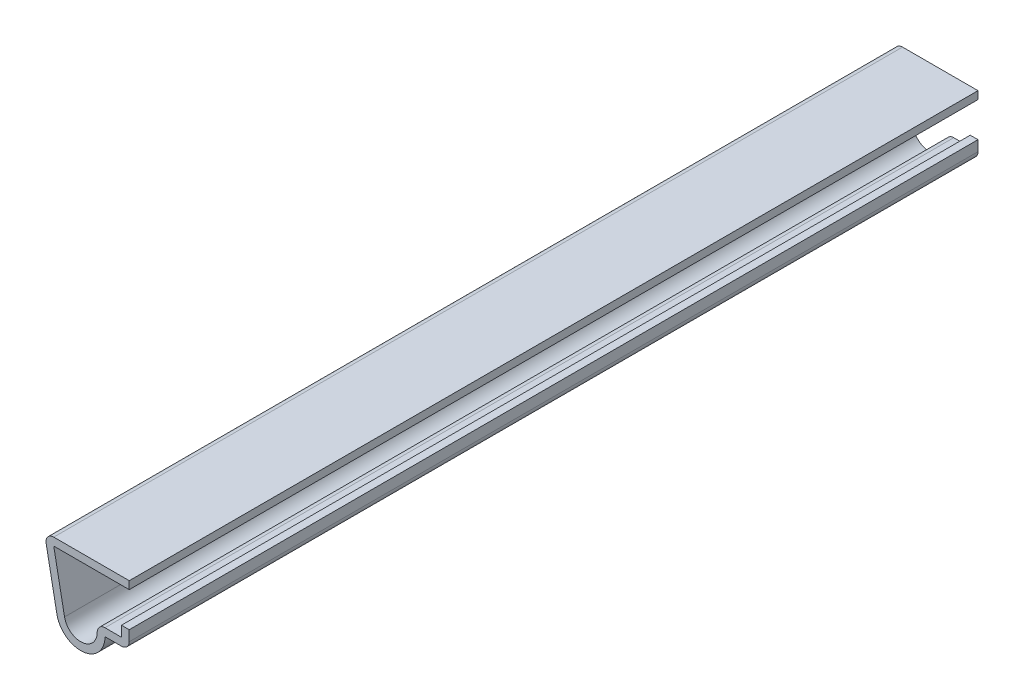
ISO-10303-21;
HEADER;
FILE_DESCRIPTION(('STEP AP214'),'2;1');
FILE_NAME('part.step','',(''),(''),'','','');
FILE_SCHEMA(('AUTOMOTIVE_DESIGN { 1 0 10303 214 1 1 1 1 }'));
ENDSEC;
DATA;
#1=APPLICATION_CONTEXT('core data for automotive mechanical design processes');
#2=APPLICATION_PROTOCOL_DEFINITION('international standard','automotive_design',2000,#1);
#3=PRODUCT_CONTEXT('',#1,'mechanical');
#4=PRODUCT('Part','Part','',(#3));
#5=PRODUCT_RELATED_PRODUCT_CATEGORY('part','',(#4));
#6=PRODUCT_DEFINITION_FORMATION('','',#4);
#7=PRODUCT_DEFINITION_CONTEXT('part definition',#1,'design');
#8=PRODUCT_DEFINITION('design','',#6,#7);
#9=PRODUCT_DEFINITION_SHAPE('','',#8);
#10=(LENGTH_UNIT() NAMED_UNIT(*) SI_UNIT(.MILLI.,.METRE.));
#11=(NAMED_UNIT(*) PLANE_ANGLE_UNIT() SI_UNIT($,.RADIAN.));
#12=(NAMED_UNIT(*) SI_UNIT($,.STERADIAN.) SOLID_ANGLE_UNIT());
#13=UNCERTAINTY_MEASURE_WITH_UNIT(LENGTH_MEASURE(1.E-05),#10,'distance_accuracy_value','');
#14=(GEOMETRIC_REPRESENTATION_CONTEXT(3) GLOBAL_UNCERTAINTY_ASSIGNED_CONTEXT((#13)) GLOBAL_UNIT_ASSIGNED_CONTEXT((#10,
#11,#12)) REPRESENTATION_CONTEXT('',''));
#15=CARTESIAN_POINT('',(0.,0.,0.));
#16=DIRECTION('',(0.,0.,1.));
#17=DIRECTION('',(1.,0.,0.));
#18=AXIS2_PLACEMENT_3D('',#15,#16,#17);
#19=CARTESIAN_POINT('',(-11.1125,6.9215,-111.125));
#20=DIRECTION('',(0.,-1.,0.));
#21=DIRECTION('',(1.,0.,0.));
#22=AXIS2_PLACEMENT_3D('',#19,#20,#21);
#23=PLANE('',#22);
#24=DIRECTION('',(1.,0.,0.));
#25=VECTOR('',#24,1.);
#26=CARTESIAN_POINT('',(-11.1125,6.9215,0.));
#27=LINE('',#26,#25);
#28=CARTESIAN_POINT('',(-9.8820912593925,6.9215,0.));
#29=VERTEX_POINT('',#28);
#30=CARTESIAN_POINT('',(0.,6.9215,0.));
#31=VERTEX_POINT('',#30);
#32=EDGE_CURVE('E192',#29,#31,#27,.T.);
#33=ORIENTED_EDGE('',*,*,#32,.F.);
#34=DIRECTION('',(0.,0.,1.));
#35=VECTOR('',#34,1.);
#36=CARTESIAN_POINT('',(-9.8820912593925,6.9215,-111.125));
#37=LINE('',#36,#35);
#38=CARTESIAN_POINT('',(-9.8820912593925,6.9215,-111.125));
#39=VERTEX_POINT('',#38);
#40=EDGE_CURVE('E165',#39,#29,#37,.T.);
#41=ORIENTED_EDGE('',*,*,#40,.F.);
#42=DIRECTION('',(1.,0.,0.));
#43=VECTOR('',#42,1.);
#44=CARTESIAN_POINT('',(-11.1125,6.9215,-111.125));
#45=LINE('',#44,#43);
#46=CARTESIAN_POINT('',(0.,6.9215,-111.125));
#47=VERTEX_POINT('',#46);
#48=EDGE_CURVE('E147',#39,#47,#45,.T.);
#49=ORIENTED_EDGE('',*,*,#48,.T.);
#50=DIRECTION('',(0.,0.,1.));
#51=VECTOR('',#50,1.);
#52=CARTESIAN_POINT('',(0.,6.9215,-111.125));
#53=LINE('',#52,#51);
#54=EDGE_CURVE('E155',#47,#31,#53,.T.);
#55=ORIENTED_EDGE('',*,*,#54,.T.);
#56=EDGE_LOOP('',(#33,#41,#49,#55));
#57=FACE_BOUND('',#56,.T.);
#58=ADVANCED_FACE('F35',(#57),#23,.T.);
#59=CARTESIAN_POINT('',(-8.47001912007891,-0.408411472047341,-111.125));
#60=DIRECTION('',(0.981944937507597,0.189166962504558,0.));
#61=DIRECTION('',(-0.189166962504558,0.981944937507597,0.));
#62=AXIS2_PLACEMENT_3D('',#59,#60,#61);
#63=PLANE('',#62);
#64=DIRECTION('',(-0.189166962504558,0.981944937507597,0.));
#65=VECTOR('',#64,1.);
#66=CARTESIAN_POINT('',(-8.47001912007891,-0.408411472047341,0.));
#67=LINE('',#66,#65);
#68=CARTESIAN_POINT('',(-8.47001912007891,-0.408411472047341,0.));
#69=VERTEX_POINT('',#68);
#70=EDGE_CURVE('E166',#69,#29,#67,.T.);
#71=ORIENTED_EDGE('',*,*,#70,.F.);
#72=DIRECTION('',(0.,0.,1.));
#73=VECTOR('',#72,1.);
#74=CARTESIAN_POINT('',(-8.47001912007891,-0.408411472047341,-111.125));
#75=LINE('',#74,#73);
#76=CARTESIAN_POINT('',(-8.47001912007891,-0.408411472047341,-111.125));
#77=VERTEX_POINT('',#76);
#78=EDGE_CURVE('E217',#77,#69,#75,.T.);
#79=ORIENTED_EDGE('',*,*,#78,.F.);
#80=DIRECTION('',(-0.189166962504558,0.981944937507597,0.));
#81=VECTOR('',#80,1.);
#82=CARTESIAN_POINT('',(-8.47001912007891,-0.408411472047341,-111.125));
#83=LINE('',#82,#81);
#84=EDGE_CURVE('E163',#77,#39,#83,.T.);
#85=ORIENTED_EDGE('',*,*,#84,.T.);
#86=ORIENTED_EDGE('',*,*,#40,.T.);
#87=EDGE_LOOP('',(#71,#79,#85,#86));
#88=FACE_BOUND('',#87,.T.);
#89=ADVANCED_FACE('F267',(#88),#63,.T.);
#90=CARTESIAN_POINT('',(-6.35,0.,-111.125));
#91=DIRECTION('',(0.,0.,1.));
#92=DIRECTION('',(1.,0.,0.));
#93=AXIS2_PLACEMENT_3D('',#90,#91,#92);
#94=CYLINDRICAL_SURFACE('',#93,2.159);
#95=CARTESIAN_POINT('',(-6.35,0.,0.));
#96=DIRECTION('',(0.,0.,1.));
#97=DIRECTION('',(1.,0.,0.));
#98=AXIS2_PLACEMENT_3D('',#95,#96,#97);
#99=CIRCLE('',#98,2.159);
#100=CARTESIAN_POINT('',(-4.191,0.,0.));
#101=VERTEX_POINT('',#100);
#102=EDGE_CURVE('E169',#101,#69,#99,.F.);
#103=ORIENTED_EDGE('',*,*,#102,.F.);
#104=DIRECTION('',(0.,0.,1.));
#105=VECTOR('',#104,1.);
#106=CARTESIAN_POINT('',(-4.191,0.,-111.125));
#107=LINE('',#106,#105);
#108=CARTESIAN_POINT('',(-4.191,0.,-111.125));
#109=VERTEX_POINT('',#108);
#110=EDGE_CURVE('E252',#101,#109,#107,.F.);
#111=ORIENTED_EDGE('',*,*,#110,.T.);
#112=CARTESIAN_POINT('',(-6.35,0.,-111.125));
#113=DIRECTION('',(0.,0.,1.));
#114=DIRECTION('',(1.,0.,0.));
#115=AXIS2_PLACEMENT_3D('',#112,#113,#114);
#116=CIRCLE('',#115,2.159);
#117=EDGE_CURVE('E189',#109,#77,#116,.F.);
#118=ORIENTED_EDGE('',*,*,#117,.T.);
#119=ORIENTED_EDGE('',*,*,#78,.T.);
#120=EDGE_LOOP('',(#103,#111,#118,#119));
#121=FACE_BOUND('',#120,.T.);
#122=ADVANCED_FACE('F315',(#121),#94,.F.);
#123=CARTESIAN_POINT('',(0.,1.016,-111.125));
#124=DIRECTION('',(0.,1.,0.));
#125=DIRECTION('',(-1.,0.,0.));
#126=AXIS2_PLACEMENT_3D('',#123,#124,#125);
#127=PLANE('',#126);
#128=DIRECTION('',(-1.,0.,0.));
#129=VECTOR('',#128,1.);
#130=CARTESIAN_POINT('',(0.,1.016,-111.125));
#131=LINE('',#130,#129);
#132=CARTESIAN_POINT('',(-1.016,1.016,-111.125));
#133=VERTEX_POINT('',#132);
#134=CARTESIAN_POINT('',(-3.175,1.016,-111.125));
#135=VERTEX_POINT('',#134);
#136=EDGE_CURVE('E186',#133,#135,#131,.T.);
#137=ORIENTED_EDGE('',*,*,#136,.T.);
#138=DIRECTION('',(0.,0.,1.));
#139=VECTOR('',#138,1.);
#140=CARTESIAN_POINT('',(-3.175,1.016,-111.125));
#141=LINE('',#140,#139);
#142=CARTESIAN_POINT('',(-3.175,1.016,0.));
#143=VERTEX_POINT('',#142);
#144=EDGE_CURVE('E249',#135,#143,#141,.T.);
#145=ORIENTED_EDGE('',*,*,#144,.T.);
#146=DIRECTION('',(-1.,0.,0.));
#147=VECTOR('',#146,1.);
#148=CARTESIAN_POINT('',(0.,1.016,0.));
#149=LINE('',#148,#147);
#150=CARTESIAN_POINT('',(-1.016,1.016,0.));
#151=VERTEX_POINT('',#150);
#152=EDGE_CURVE('E211',#151,#143,#149,.T.);
#153=ORIENTED_EDGE('',*,*,#152,.F.);
#154=DIRECTION('',(0.,0.,1.));
#155=VECTOR('',#154,1.);
#156=CARTESIAN_POINT('',(-1.016,1.016,-111.125));
#157=LINE('',#156,#155);
#158=EDGE_CURVE('E220',#133,#151,#157,.T.);
#159=ORIENTED_EDGE('',*,*,#158,.F.);
#160=EDGE_LOOP('',(#137,#145,#153,#159));
#161=FACE_BOUND('',#160,.T.);
#162=ADVANCED_FACE('F278',(#161),#127,.T.);
#163=CARTESIAN_POINT('',(-1.016,2.38125,-111.125));
#164=DIRECTION('',(-1.,0.,0.));
#165=DIRECTION('',(0.,-1.,0.));
#166=AXIS2_PLACEMENT_3D('',#163,#164,#165);
#167=PLANE('',#166);
#168=DIRECTION('',(0.,-1.,0.));
#169=VECTOR('',#168,1.);
#170=CARTESIAN_POINT('',(-1.016,2.38125,0.));
#171=LINE('',#170,#169);
#172=CARTESIAN_POINT('',(-1.016,2.38125,0.));
#173=VERTEX_POINT('',#172);
#174=EDGE_CURVE('E208',#173,#151,#171,.T.);
#175=ORIENTED_EDGE('',*,*,#174,.F.);
#176=DIRECTION('',(0.,0.,1.));
#177=VECTOR('',#176,1.);
#178=CARTESIAN_POINT('',(-1.016,2.38125,-111.125));
#179=LINE('',#178,#177);
#180=CARTESIAN_POINT('',(-1.016,2.38125,-111.125));
#181=VERTEX_POINT('',#180);
#182=EDGE_CURVE('E222',#181,#173,#179,.T.);
#183=ORIENTED_EDGE('',*,*,#182,.F.);
#184=DIRECTION('',(0.,-1.,0.));
#185=VECTOR('',#184,1.);
#186=CARTESIAN_POINT('',(-1.016,2.38125,-111.125));
#187=LINE('',#186,#185);
#188=EDGE_CURVE('E183',#181,#133,#187,.T.);
#189=ORIENTED_EDGE('',*,*,#188,.T.);
#190=ORIENTED_EDGE('',*,*,#158,.T.);
#191=EDGE_LOOP('',(#175,#183,#189,#190));
#192=FACE_BOUND('',#191,.T.);
#193=ADVANCED_FACE('F283',(#192),#167,.T.);
#194=CARTESIAN_POINT('',(-1.016,2.38125,-111.125));
#195=DIRECTION('',(0.,-1.,0.));
#196=DIRECTION('',(0.,0.,-1.));
#197=AXIS2_PLACEMENT_3D('',#194,#195,#196);
#198=PLANE('',#197);
#199=DIRECTION('',(1.,0.,0.));
#200=VECTOR('',#199,1.);
#201=CARTESIAN_POINT('',(-1.016,2.38125,0.));
#202=LINE('',#201,#200);
#203=CARTESIAN_POINT('',(0.,2.38125,0.));
#204=VERTEX_POINT('',#203);
#205=EDGE_CURVE('E206',#173,#204,#202,.T.);
#206=ORIENTED_EDGE('',*,*,#205,.T.);
#207=DIRECTION('',(0.,0.,1.));
#208=VECTOR('',#207,1.);
#209=CARTESIAN_POINT('',(0.,2.38125,-111.125));
#210=LINE('',#209,#208);
#211=CARTESIAN_POINT('',(0.,2.38125,-111.125));
#212=VERTEX_POINT('',#211);
#213=EDGE_CURVE('E224',#212,#204,#210,.T.);
#214=ORIENTED_EDGE('',*,*,#213,.F.);
#215=DIRECTION('',(1.,0.,0.));
#216=VECTOR('',#215,1.);
#217=CARTESIAN_POINT('',(-1.016,2.38125,-111.125));
#218=LINE('',#217,#216);
#219=EDGE_CURVE('E181',#181,#212,#218,.T.);
#220=ORIENTED_EDGE('',*,*,#219,.F.);
#221=ORIENTED_EDGE('',*,*,#182,.T.);
#222=EDGE_LOOP('',(#206,#214,#220,#221));
#223=FACE_BOUND('',#222,.T.);
#224=ADVANCED_FACE('F290',(#223),#198,.F.);
#225=CARTESIAN_POINT('',(0.,2.38125,-111.125));
#226=DIRECTION('',(-1.,0.,0.));
#227=DIRECTION('',(0.,-1.,0.));
#228=AXIS2_PLACEMENT_3D('',#225,#226,#227);
#229=PLANE('',#228);
#230=DIRECTION('',(0.,-1.,0.));
#231=VECTOR('',#230,1.);
#232=CARTESIAN_POINT('',(0.,2.38125,0.));
#233=LINE('',#232,#231);
#234=CARTESIAN_POINT('',(0.,1.016,0.));
#235=VERTEX_POINT('',#234);
#236=EDGE_CURVE('E203',#204,#235,#233,.T.);
#237=ORIENTED_EDGE('',*,*,#236,.T.);
#238=DIRECTION('',(0.,0.,1.));
#239=VECTOR('',#238,1.);
#240=CARTESIAN_POINT('',(0.,1.016,-111.125));
#241=LINE('',#240,#239);
#242=CARTESIAN_POINT('',(0.,1.016,-111.125));
#243=VERTEX_POINT('',#242);
#244=EDGE_CURVE('E242',#235,#243,#241,.F.);
#245=ORIENTED_EDGE('',*,*,#244,.T.);
#246=DIRECTION('',(0.,-1.,0.));
#247=VECTOR('',#246,1.);
#248=CARTESIAN_POINT('',(0.,2.38125,-111.125));
#249=LINE('',#248,#247);
#250=EDGE_CURVE('E179',#212,#243,#249,.T.);
#251=ORIENTED_EDGE('',*,*,#250,.F.);
#252=ORIENTED_EDGE('',*,*,#213,.T.);
#253=EDGE_LOOP('',(#237,#245,#251,#252));
#254=FACE_BOUND('',#253,.T.);
#255=ADVANCED_FACE('F292',(#254),#229,.F.);
#256=CARTESIAN_POINT('',(0.,0.,-111.125));
#257=DIRECTION('',(0.,1.,0.));
#258=DIRECTION('',(-1.,0.,0.));
#259=AXIS2_PLACEMENT_3D('',#256,#257,#258);
#260=PLANE('',#259);
#261=DIRECTION('',(-1.,0.,0.));
#262=VECTOR('',#261,1.);
#263=CARTESIAN_POINT('',(0.,0.,-111.125));
#264=LINE('',#263,#262);
#265=CARTESIAN_POINT('',(-1.016,0.,-111.125));
#266=VERTEX_POINT('',#265);
#267=CARTESIAN_POINT('',(-3.175,0.,-111.125));
#268=VERTEX_POINT('',#267);
#269=EDGE_CURVE('E177',#266,#268,#264,.T.);
#270=ORIENTED_EDGE('',*,*,#269,.F.);
#271=DIRECTION('',(0.,0.,1.));
#272=VECTOR('',#271,1.);
#273=CARTESIAN_POINT('',(-1.016,0.,-111.125));
#274=LINE('',#273,#272);
#275=CARTESIAN_POINT('',(-1.016,0.,0.));
#276=VERTEX_POINT('',#275);
#277=EDGE_CURVE('E216',#266,#276,#274,.T.);
#278=ORIENTED_EDGE('',*,*,#277,.T.);
#279=DIRECTION('',(-1.,0.,0.));
#280=VECTOR('',#279,1.);
#281=CARTESIAN_POINT('',(0.,0.,0.));
#282=LINE('',#281,#280);
#283=CARTESIAN_POINT('',(-3.175,0.,0.));
#284=VERTEX_POINT('',#283);
#285=EDGE_CURVE('E201',#276,#284,#282,.T.);
#286=ORIENTED_EDGE('',*,*,#285,.T.);
#287=DIRECTION('',(0.,0.,1.));
#288=VECTOR('',#287,1.);
#289=CARTESIAN_POINT('',(-3.175,0.,-111.125));
#290=LINE('',#289,#288);
#291=EDGE_CURVE('E227',#268,#284,#290,.T.);
#292=ORIENTED_EDGE('',*,*,#291,.F.);
#293=EDGE_LOOP('',(#270,#278,#286,#292));
#294=FACE_BOUND('',#293,.T.);
#295=ADVANCED_FACE('F300',(#294),#260,.F.);
#296=CARTESIAN_POINT('',(-6.35,0.,-111.125));
#297=DIRECTION('',(0.,0.,1.));
#298=DIRECTION('',(1.,0.,0.));
#299=AXIS2_PLACEMENT_3D('',#296,#297,#298);
#300=CYLINDRICAL_SURFACE('',#299,3.175);
#301=CARTESIAN_POINT('',(-6.35,0.,0.));
#302=DIRECTION('',(0.,0.,-1.));
#303=DIRECTION('',(-1.,0.,0.));
#304=AXIS2_PLACEMENT_3D('',#301,#302,#303);
#305=CIRCLE('',#304,3.175);
#306=CARTESIAN_POINT('',(-9.46767517658662,-0.600605105951972,0.));
#307=VERTEX_POINT('',#306);
#308=EDGE_CURVE('E199',#284,#307,#305,.T.);
#309=ORIENTED_EDGE('',*,*,#308,.T.);
#310=DIRECTION('',(0.,0.,1.));
#311=VECTOR('',#310,1.);
#312=CARTESIAN_POINT('',(-9.46767517658662,-0.600605105951972,-111.125));
#313=LINE('',#312,#311);
#314=CARTESIAN_POINT('',(-9.46767517658662,-0.600605105951972,-111.125));
#315=VERTEX_POINT('',#314);
#316=EDGE_CURVE('E230',#315,#307,#313,.T.);
#317=ORIENTED_EDGE('',*,*,#316,.F.);
#318=CARTESIAN_POINT('',(-6.35,0.,-111.125));
#319=DIRECTION('',(0.,0.,-1.));
#320=DIRECTION('',(-1.,0.,0.));
#321=AXIS2_PLACEMENT_3D('',#318,#319,#320);
#322=CIRCLE('',#321,3.175);
#323=EDGE_CURVE('E175',#268,#315,#322,.T.);
#324=ORIENTED_EDGE('',*,*,#323,.F.);
#325=ORIENTED_EDGE('',*,*,#291,.T.);
#326=EDGE_LOOP('',(#309,#317,#324,#325));
#327=FACE_BOUND('',#326,.T.);
#328=ADVANCED_FACE('F305',(#327),#300,.T.);
#329=CARTESIAN_POINT('',(-9.46767517658662,-0.600605105951972,-111.125));
#330=DIRECTION('',(0.981944937507597,0.189166962504558,0.));
#331=DIRECTION('',(-0.189166962504558,0.981944937507597,0.));
#332=AXIS2_PLACEMENT_3D('',#329,#330,#331);
#333=PLANE('',#332);
#334=DIRECTION('',(-0.189166962504558,0.981944937507597,0.));
#335=VECTOR('',#334,1.);
#336=CARTESIAN_POINT('',(-9.46767517658662,-0.600605105951972,0.));
#337=LINE('',#336,#335);
#338=CARTESIAN_POINT('',(-10.8797473159002,6.72930636609537,0.));
#339=VERTEX_POINT('',#338);
#340=EDGE_CURVE('E197',#307,#339,#337,.T.);
#341=ORIENTED_EDGE('',*,*,#340,.T.);
#342=DIRECTION('',(0.,0.,1.));
#343=VECTOR('',#342,1.);
#344=CARTESIAN_POINT('',(-10.8797473159002,6.72930636609537,-111.125));
#345=LINE('',#344,#343);
#346=CARTESIAN_POINT('',(-10.8797473159002,6.72930636609537,-111.125));
#347=VERTEX_POINT('',#346);
#348=EDGE_CURVE('E11',#339,#347,#345,.F.);
#349=ORIENTED_EDGE('',*,*,#348,.T.);
#350=DIRECTION('',(-0.189166962504558,0.981944937507597,0.));
#351=VECTOR('',#350,1.);
#352=CARTESIAN_POINT('',(-9.46767517658662,-0.600605105951972,-111.125));
#353=LINE('',#352,#351);
#354=EDGE_CURVE('E173',#315,#347,#353,.T.);
#355=ORIENTED_EDGE('',*,*,#354,.F.);
#356=ORIENTED_EDGE('',*,*,#316,.T.);
#357=EDGE_LOOP('',(#341,#349,#355,#356));
#358=FACE_BOUND('',#357,.T.);
#359=ADVANCED_FACE('F344',(#358),#333,.F.);
#360=CARTESIAN_POINT('',(-11.1125,7.9375,-111.125));
#361=DIRECTION('',(0.,-1.,0.));
#362=DIRECTION('',(1.,0.,0.));
#363=AXIS2_PLACEMENT_3D('',#360,#361,#362);
#364=PLANE('',#363);
#365=DIRECTION('',(1.,0.,0.));
#366=VECTOR('',#365,1.);
#367=CARTESIAN_POINT('',(-11.1125,7.9375,-111.125));
#368=LINE('',#367,#366);
#369=CARTESIAN_POINT('',(-9.8820912593925,7.9375,-111.125));
#370=VERTEX_POINT('',#369);
#371=CARTESIAN_POINT('',(0.,7.9375,-111.125));
#372=VERTEX_POINT('',#371);
#373=EDGE_CURVE('E149',#370,#372,#368,.T.);
#374=ORIENTED_EDGE('',*,*,#373,.F.);
#375=DIRECTION('',(0.,0.,1.));
#376=VECTOR('',#375,1.);
#377=CARTESIAN_POINT('',(-9.8820912593925,7.9375,-111.125));
#378=LINE('',#377,#376);
#379=CARTESIAN_POINT('',(-9.8820912593925,7.9375,0.));
#380=VERTEX_POINT('',#379);
#381=EDGE_CURVE('E43',#370,#380,#378,.T.);
#382=ORIENTED_EDGE('',*,*,#381,.T.);
#383=DIRECTION('',(1.,0.,0.));
#384=VECTOR('',#383,1.);
#385=CARTESIAN_POINT('',(-11.1125,7.9375,0.));
#386=LINE('',#385,#384);
#387=CARTESIAN_POINT('',(0.,7.9375,0.));
#388=VERTEX_POINT('',#387);
#389=EDGE_CURVE('E195',#380,#388,#386,.T.);
#390=ORIENTED_EDGE('',*,*,#389,.T.);
#391=DIRECTION('',(0.,0.,1.));
#392=VECTOR('',#391,1.);
#393=CARTESIAN_POINT('',(0.,7.9375,-111.125));
#394=LINE('',#393,#392);
#395=EDGE_CURVE('E162',#372,#388,#394,.T.);
#396=ORIENTED_EDGE('',*,*,#395,.F.);
#397=EDGE_LOOP('',(#374,#382,#390,#396));
#398=FACE_BOUND('',#397,.T.);
#399=ADVANCED_FACE('F257',(#398),#364,.F.);
#400=CARTESIAN_POINT('',(0.,7.9375,-111.125));
#401=DIRECTION('',(-1.,0.,0.));
#402=DIRECTION('',(0.,0.,1.));
#403=AXIS2_PLACEMENT_3D('',#400,#401,#402);
#404=PLANE('',#403);
#405=DIRECTION('',(0.,-1.,0.));
#406=VECTOR('',#405,1.);
#407=CARTESIAN_POINT('',(0.,7.9375,0.));
#408=LINE('',#407,#406);
#409=EDGE_CURVE('E158',#388,#31,#408,.T.);
#410=ORIENTED_EDGE('',*,*,#409,.T.);
#411=ORIENTED_EDGE('',*,*,#54,.F.);
#412=DIRECTION('',(0.,-1.,0.));
#413=VECTOR('',#412,1.);
#414=CARTESIAN_POINT('',(0.,7.9375,-111.125));
#415=LINE('',#414,#413);
#416=EDGE_CURVE('E141',#372,#47,#415,.T.);
#417=ORIENTED_EDGE('',*,*,#416,.F.);
#418=ORIENTED_EDGE('',*,*,#395,.T.);
#419=EDGE_LOOP('',(#410,#411,#417,#418));
#420=FACE_BOUND('',#419,.T.);
#421=ADVANCED_FACE('F156',(#420),#404,.F.);
#422=CARTESIAN_POINT('',(-6.35,0.,-111.125));
#423=DIRECTION('',(0.,0.,-1.));
#424=DIRECTION('',(-1.,0.,0.));
#425=AXIS2_PLACEMENT_3D('',#422,#423,#424);
#426=PLANE('',#425);
#427=ORIENTED_EDGE('',*,*,#250,.T.);
#428=CARTESIAN_POINT('',(-1.016,1.016,-111.125));
#429=DIRECTION('',(0.,0.,-1.));
#430=DIRECTION('',(-1.,0.,0.));
#431=AXIS2_PLACEMENT_3D('',#428,#429,#430);
#432=CIRCLE('',#431,1.016);
#433=EDGE_CURVE('E247',#243,#266,#432,.T.);
#434=ORIENTED_EDGE('',*,*,#433,.T.);
#435=ORIENTED_EDGE('',*,*,#269,.T.);
#436=ORIENTED_EDGE('',*,*,#323,.T.);
#437=ORIENTED_EDGE('',*,*,#354,.T.);
#438=CARTESIAN_POINT('',(-9.8820912593925,6.9215,-111.125));
#439=DIRECTION('',(0.,0.,-1.));
#440=DIRECTION('',(-1.,0.,0.));
#441=AXIS2_PLACEMENT_3D('',#438,#439,#440);
#442=CIRCLE('',#441,1.016);
#443=EDGE_CURVE('E50',#347,#370,#442,.T.);
#444=ORIENTED_EDGE('',*,*,#443,.T.);
#445=ORIENTED_EDGE('',*,*,#373,.T.);
#446=ORIENTED_EDGE('',*,*,#416,.T.);
#447=ORIENTED_EDGE('',*,*,#48,.F.);
#448=ORIENTED_EDGE('',*,*,#84,.F.);
#449=ORIENTED_EDGE('',*,*,#117,.F.);
#450=CARTESIAN_POINT('',(-3.175,0.,-111.125));
#451=DIRECTION('',(0.,0.,-1.));
#452=DIRECTION('',(-1.,0.,0.));
#453=AXIS2_PLACEMENT_3D('',#450,#451,#452);
#454=CIRCLE('',#453,1.016);
#455=EDGE_CURVE('E245',#109,#135,#454,.T.);
#456=ORIENTED_EDGE('',*,*,#455,.T.);
#457=ORIENTED_EDGE('',*,*,#136,.F.);
#458=ORIENTED_EDGE('',*,*,#188,.F.);
#459=ORIENTED_EDGE('',*,*,#219,.T.);
#460=EDGE_LOOP('',(#427,#434,#435,#436,#437,#444,#445,#446,#447,#448,#449,#456,#457,#458,#459));
#461=FACE_BOUND('',#460,.T.);
#462=ADVANCED_FACE('F144',(#461),#426,.T.);
#463=CARTESIAN_POINT('',(-6.35,0.,0.));
#464=DIRECTION('',(0.,0.,-1.));
#465=DIRECTION('',(-1.,0.,0.));
#466=AXIS2_PLACEMENT_3D('',#463,#464,#465);
#467=PLANE('',#466);
#468=ORIENTED_EDGE('',*,*,#285,.F.);
#469=CARTESIAN_POINT('',(-1.016,1.016,0.));
#470=DIRECTION('',(0.,0.,-1.));
#471=DIRECTION('',(-1.,0.,0.));
#472=AXIS2_PLACEMENT_3D('',#469,#470,#471);
#473=CIRCLE('',#472,1.016);
#474=EDGE_CURVE('E240',#276,#235,#473,.F.);
#475=ORIENTED_EDGE('',*,*,#474,.T.);
#476=ORIENTED_EDGE('',*,*,#236,.F.);
#477=ORIENTED_EDGE('',*,*,#205,.F.);
#478=ORIENTED_EDGE('',*,*,#174,.T.);
#479=ORIENTED_EDGE('',*,*,#152,.T.);
#480=CARTESIAN_POINT('',(-3.175,0.,0.));
#481=DIRECTION('',(0.,0.,-1.));
#482=DIRECTION('',(-1.,0.,0.));
#483=AXIS2_PLACEMENT_3D('',#480,#481,#482);
#484=CIRCLE('',#483,1.016);
#485=EDGE_CURVE('E238',#143,#101,#484,.F.);
#486=ORIENTED_EDGE('',*,*,#485,.T.);
#487=ORIENTED_EDGE('',*,*,#102,.T.);
#488=ORIENTED_EDGE('',*,*,#70,.T.);
#489=ORIENTED_EDGE('',*,*,#32,.T.);
#490=ORIENTED_EDGE('',*,*,#409,.F.);
#491=ORIENTED_EDGE('',*,*,#389,.F.);
#492=CARTESIAN_POINT('',(-9.8820912593925,6.9215,0.));
#493=DIRECTION('',(0.,0.,-1.));
#494=DIRECTION('',(-1.,0.,0.));
#495=AXIS2_PLACEMENT_3D('',#492,#493,#494);
#496=CIRCLE('',#495,1.016);
#497=EDGE_CURVE('E236',#380,#339,#496,.F.);
#498=ORIENTED_EDGE('',*,*,#497,.T.);
#499=ORIENTED_EDGE('',*,*,#340,.F.);
#500=ORIENTED_EDGE('',*,*,#308,.F.);
#501=EDGE_LOOP('',(#468,#475,#476,#477,#478,#479,#486,#487,#488,#489,#490,#491,#498,#499,#500));
#502=FACE_BOUND('',#501,.T.);
#503=ADVANCED_FACE('F261',(#502),#467,.F.);
#504=CARTESIAN_POINT('',(-1.016,1.016,-111.125));
#505=DIRECTION('',(0.,0.,1.));
#506=DIRECTION('',(1.,0.,0.));
#507=AXIS2_PLACEMENT_3D('',#504,#505,#506);
#508=CYLINDRICAL_SURFACE('',#507,1.016);
#509=ORIENTED_EDGE('',*,*,#433,.F.);
#510=ORIENTED_EDGE('',*,*,#244,.F.);
#511=ORIENTED_EDGE('',*,*,#474,.F.);
#512=ORIENTED_EDGE('',*,*,#277,.F.);
#513=EDGE_LOOP('',(#509,#510,#511,#512));
#514=FACE_BOUND('',#513,.T.);
#515=ADVANCED_FACE('F295',(#514),#508,.T.);
#516=CARTESIAN_POINT('',(-3.175,0.,-111.125));
#517=DIRECTION('',(0.,0.,1.));
#518=DIRECTION('',(1.,0.,0.));
#519=AXIS2_PLACEMENT_3D('',#516,#517,#518);
#520=CYLINDRICAL_SURFACE('',#519,1.016);
#521=ORIENTED_EDGE('',*,*,#455,.F.);
#522=ORIENTED_EDGE('',*,*,#110,.F.);
#523=ORIENTED_EDGE('',*,*,#485,.F.);
#524=ORIENTED_EDGE('',*,*,#144,.F.);
#525=EDGE_LOOP('',(#521,#522,#523,#524));
#526=FACE_BOUND('',#525,.T.);
#527=ADVANCED_FACE('F275',(#526),#520,.T.);
#528=CARTESIAN_POINT('',(-9.8820912593925,6.9215,-111.125));
#529=DIRECTION('',(0.,0.,1.));
#530=DIRECTION('',(1.,0.,0.));
#531=AXIS2_PLACEMENT_3D('',#528,#529,#530);
#532=CYLINDRICAL_SURFACE('',#531,1.016);
#533=ORIENTED_EDGE('',*,*,#443,.F.);
#534=ORIENTED_EDGE('',*,*,#348,.F.);
#535=ORIENTED_EDGE('',*,*,#497,.F.);
#536=ORIENTED_EDGE('',*,*,#381,.F.);
#537=EDGE_LOOP('',(#533,#534,#535,#536));
#538=FACE_BOUND('',#537,.T.);
#539=ADVANCED_FACE('F37',(#538),#532,.T.);
#540=CLOSED_SHELL('',(#58,#89,#122,#162,#193,#224,#255,#295,#328,#359,#399,#421,#462,#503,#515,
#527,#539));
#541=MANIFOLD_SOLID_BREP('B2',#540);
#542=ADVANCED_BREP_SHAPE_REPRESENTATION('',(#18,#541),#14);
#543=SHAPE_DEFINITION_REPRESENTATION(#9,#542);
ENDSEC;
END-ISO-10303-21;
